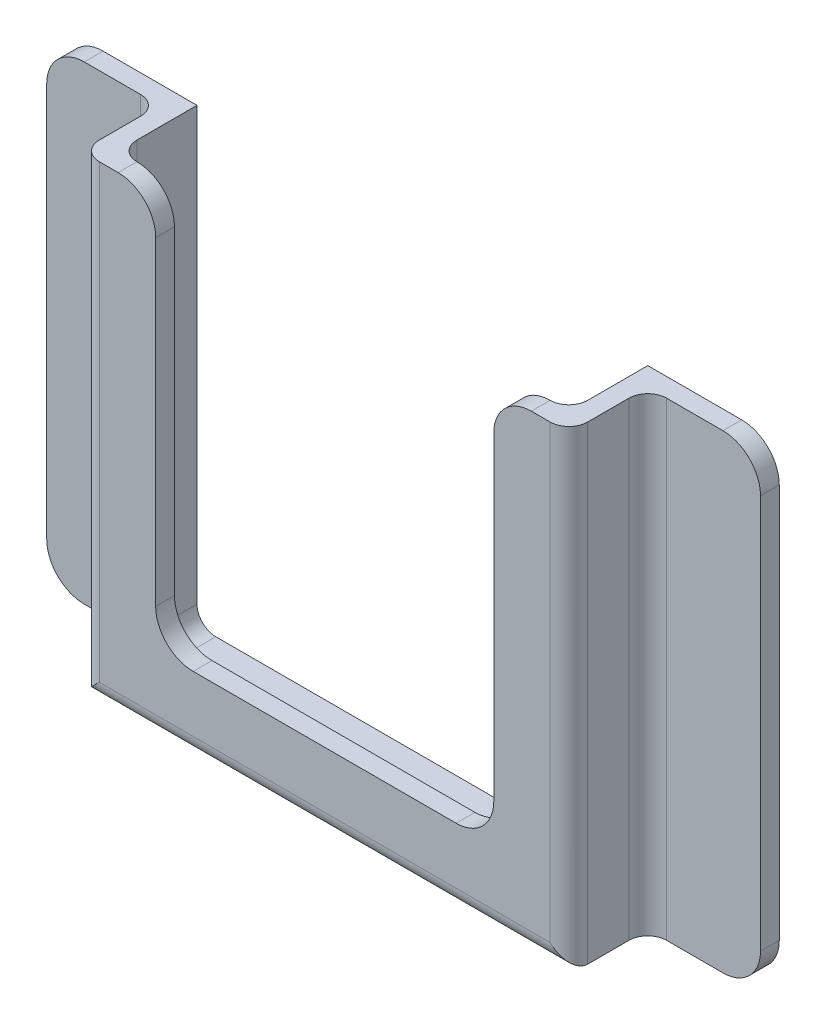
ISO-10303-21;
HEADER;
FILE_DESCRIPTION(('STEP AP214'),'2;1');
FILE_NAME('part.step','',(''),(''),'','','');
FILE_SCHEMA(('AUTOMOTIVE_DESIGN { 1 0 10303 214 1 1 1 1 }'));
ENDSEC;
DATA;
#1=APPLICATION_CONTEXT('core data for automotive mechanical design processes');
#2=APPLICATION_PROTOCOL_DEFINITION('international standard','automotive_design',2000,#1);
#3=PRODUCT_CONTEXT('',#1,'mechanical');
#4=PRODUCT('Part','Part','',(#3));
#5=PRODUCT_RELATED_PRODUCT_CATEGORY('part','',(#4));
#6=PRODUCT_DEFINITION_FORMATION('','',#4);
#7=PRODUCT_DEFINITION_CONTEXT('part definition',#1,'design');
#8=PRODUCT_DEFINITION('design','',#6,#7);
#9=PRODUCT_DEFINITION_SHAPE('','',#8);
#10=(LENGTH_UNIT() NAMED_UNIT(*) SI_UNIT(.MILLI.,.METRE.));
#11=(NAMED_UNIT(*) PLANE_ANGLE_UNIT() SI_UNIT($,.RADIAN.));
#12=(NAMED_UNIT(*) SI_UNIT($,.STERADIAN.) SOLID_ANGLE_UNIT());
#13=UNCERTAINTY_MEASURE_WITH_UNIT(LENGTH_MEASURE(1.E-05),#10,'distance_accuracy_value','');
#14=(GEOMETRIC_REPRESENTATION_CONTEXT(3) GLOBAL_UNCERTAINTY_ASSIGNED_CONTEXT((#13)) GLOBAL_UNIT_ASSIGNED_CONTEXT((#10,
#11,#12)) REPRESENTATION_CONTEXT('',''));
#15=CARTESIAN_POINT('',(0.,0.,0.));
#16=DIRECTION('',(0.,0.,1.));
#17=DIRECTION('',(1.,0.,0.));
#18=AXIS2_PLACEMENT_3D('',#15,#16,#17);
#19=CARTESIAN_POINT('',(0.,0.,10.5));
#20=DIRECTION('',(-1.,0.,0.));
#21=DIRECTION('',(0.,-1.,0.));
#22=AXIS2_PLACEMENT_3D('',#19,#20,#21);
#23=PLANE('',#22);
#24=DIRECTION('',(0.,0.,-1.));
#25=VECTOR('',#24,1.);
#26=CARTESIAN_POINT('',(0.,60.,10.5));
#27=LINE('',#26,#25);
#28=CARTESIAN_POINT('',(0.,60.,8.));
#29=VERTEX_POINT('',#28);
#30=CARTESIAN_POINT('',(0.,60.,0.));
#31=VERTEX_POINT('',#30);
#32=EDGE_CURVE('E244',#29,#31,#27,.T.);
#33=ORIENTED_EDGE('',*,*,#32,.F.);
#34=DIRECTION('',(0.,1.,0.));
#35=VECTOR('',#34,1.);
#36=CARTESIAN_POINT('',(0.,0.,8.));
#37=LINE('',#36,#35);
#38=CARTESIAN_POINT('',(0.,2.5,8.));
#39=VERTEX_POINT('',#38);
#40=EDGE_CURVE('E357',#29,#39,#37,.F.);
#41=ORIENTED_EDGE('',*,*,#40,.T.);
#42=DIRECTION('',(0.,0.,-1.));
#43=VECTOR('',#42,1.);
#44=CARTESIAN_POINT('',(0.,2.5,0.));
#45=LINE('',#44,#43);
#46=CARTESIAN_POINT('',(0.,2.5,0.));
#47=VERTEX_POINT('',#46);
#48=EDGE_CURVE('E247',#39,#47,#45,.T.);
#49=ORIENTED_EDGE('',*,*,#48,.T.);
#50=DIRECTION('',(0.,1.,0.));
#51=VECTOR('',#50,1.);
#52=CARTESIAN_POINT('',(0.,0.,0.));
#53=LINE('',#52,#51);
#54=EDGE_CURVE('E242',#47,#31,#53,.T.);
#55=ORIENTED_EDGE('',*,*,#54,.T.);
#56=EDGE_LOOP('',(#33,#41,#49,#55));
#57=FACE_BOUND('',#56,.T.);
#58=ADVANCED_FACE('F43',(#57),#23,.F.);
#59=CARTESIAN_POINT('',(-2.5,60.,10.5));
#60=DIRECTION('',(0.,-1.,0.));
#61=DIRECTION('',(0.,0.,-1.));
#62=AXIS2_PLACEMENT_3D('',#59,#60,#61);
#63=PLANE('',#62);
#64=DIRECTION('',(-1.,0.,0.));
#65=VECTOR('',#64,1.);
#66=CARTESIAN_POINT('',(-2.5,60.,0.));
#67=LINE('',#66,#65);
#68=CARTESIAN_POINT('',(-12.5,60.,0.));
#69=VERTEX_POINT('',#68);
#70=EDGE_CURVE('E252',#31,#69,#67,.T.);
#71=ORIENTED_EDGE('',*,*,#70,.T.);
#72=DIRECTION('',(0.,0.,-1.));
#73=VECTOR('',#72,1.);
#74=CARTESIAN_POINT('',(-12.5,60.,2.5));
#75=LINE('',#74,#73);
#76=CARTESIAN_POINT('',(-12.5,60.,2.5));
#77=VERTEX_POINT('',#76);
#78=EDGE_CURVE('E435',#69,#77,#75,.F.);
#79=ORIENTED_EDGE('',*,*,#78,.T.);
#80=DIRECTION('',(1.,0.,0.));
#81=VECTOR('',#80,1.);
#82=CARTESIAN_POINT('',(-2.5,60.,2.5));
#83=LINE('',#82,#81);
#84=CARTESIAN_POINT('',(-5.,60.,2.5));
#85=VERTEX_POINT('',#84);
#86=EDGE_CURVE('E408',#77,#85,#83,.T.);
#87=ORIENTED_EDGE('',*,*,#86,.T.);
#88=CARTESIAN_POINT('',(-5.,60.,5.));
#89=DIRECTION('',(0.,-1.,0.));
#90=DIRECTION('',(0.,0.,-1.));
#91=AXIS2_PLACEMENT_3D('',#88,#89,#90);
#92=CIRCLE('',#91,2.5);
#93=CARTESIAN_POINT('',(-2.5,60.,5.));
#94=VERTEX_POINT('',#93);
#95=EDGE_CURVE('E383',#85,#94,#92,.T.);
#96=ORIENTED_EDGE('',*,*,#95,.T.);
#97=DIRECTION('',(0.,0.,-1.));
#98=VECTOR('',#97,1.);
#99=CARTESIAN_POINT('',(-2.5,60.,10.5));
#100=LINE('',#99,#98);
#101=CARTESIAN_POINT('',(-2.5,60.,10.5));
#102=VERTEX_POINT('',#101);
#103=EDGE_CURVE('E264',#102,#94,#100,.T.);
#104=ORIENTED_EDGE('',*,*,#103,.F.);
#105=CARTESIAN_POINT('',(0.,60.,10.5));
#106=DIRECTION('',(0.,-1.,0.));
#107=DIRECTION('',(0.,0.,-1.));
#108=AXIS2_PLACEMENT_3D('',#105,#106,#107);
#109=CIRCLE('',#108,2.5);
#110=CARTESIAN_POINT('',(0.,60.,13.));
#111=VERTEX_POINT('',#110);
#112=EDGE_CURVE('E337',#102,#111,#109,.F.);
#113=ORIENTED_EDGE('',*,*,#112,.T.);
#114=DIRECTION('',(-1.,0.,0.));
#115=VECTOR('',#114,1.);
#116=CARTESIAN_POINT('',(-2.5,60.,13.));
#117=LINE('',#116,#115);
#118=CARTESIAN_POINT('',(2.5,60.,13.));
#119=VERTEX_POINT('',#118);
#120=EDGE_CURVE('E253',#119,#111,#117,.T.);
#121=ORIENTED_EDGE('',*,*,#120,.F.);
#122=DIRECTION('',(0.,0.,-1.));
#123=VECTOR('',#122,1.);
#124=CARTESIAN_POINT('',(2.5,60.,10.5));
#125=LINE('',#124,#123);
#126=CARTESIAN_POINT('',(2.49999999999999,60.,10.5));
#127=VERTEX_POINT('',#126);
#128=EDGE_CURVE('E432',#119,#127,#125,.T.);
#129=ORIENTED_EDGE('',*,*,#128,.T.);
#130=CARTESIAN_POINT('',(2.49999999999999,60.,8.));
#131=DIRECTION('',(0.,-1.,0.));
#132=DIRECTION('',(0.,0.,-1.));
#133=AXIS2_PLACEMENT_3D('',#130,#131,#132);
#134=CIRCLE('',#133,2.5);
#135=EDGE_CURVE('E261',#127,#29,#134,.T.);
#136=ORIENTED_EDGE('',*,*,#135,.T.);
#137=ORIENTED_EDGE('',*,*,#32,.T.);
#138=EDGE_LOOP('',(#71,#79,#87,#96,#104,#113,#121,#129,#136,#137));
#139=FACE_BOUND('',#138,.T.);
#140=ADVANCED_FACE('F257',(#139),#63,.F.);
#141=CARTESIAN_POINT('',(-2.5,-2.5,10.5));
#142=DIRECTION('',(1.,0.,0.));
#143=DIRECTION('',(0.,0.,-1.));
#144=AXIS2_PLACEMENT_3D('',#141,#142,#143);
#145=PLANE('',#144);
#146=DIRECTION('',(0.,0.,-1.));
#147=VECTOR('',#146,1.);
#148=CARTESIAN_POINT('',(-2.5,-2.5,10.5));
#149=LINE('',#148,#147);
#150=CARTESIAN_POINT('',(-2.5,-2.5,10.5));
#151=VERTEX_POINT('',#150);
#152=CARTESIAN_POINT('',(-2.5,-2.5,5.));
#153=VERTEX_POINT('',#152);
#154=EDGE_CURVE('E301',#151,#153,#149,.T.);
#155=ORIENTED_EDGE('',*,*,#154,.F.);
#156=DIRECTION('',(0.,-1.,0.));
#157=VECTOR('',#156,1.);
#158=CARTESIAN_POINT('',(-2.5,-2.5,10.5));
#159=LINE('',#158,#157);
#160=EDGE_CURVE('E334',#151,#102,#159,.F.);
#161=ORIENTED_EDGE('',*,*,#160,.T.);
#162=ORIENTED_EDGE('',*,*,#103,.T.);
#163=DIRECTION('',(0.,-1.,0.));
#164=VECTOR('',#163,1.);
#165=CARTESIAN_POINT('',(-2.5,-2.5,5.));
#166=LINE('',#165,#164);
#167=EDGE_CURVE('E330',#94,#153,#166,.T.);
#168=ORIENTED_EDGE('',*,*,#167,.T.);
#169=EDGE_LOOP('',(#155,#161,#162,#168));
#170=FACE_BOUND('',#169,.T.);
#171=ADVANCED_FACE('F582',(#170),#145,.F.);
#172=CARTESIAN_POINT('',(-2.5,-2.5,10.5));
#173=DIRECTION('',(0.,1.,0.));
#174=DIRECTION('',(0.,0.,1.));
#175=AXIS2_PLACEMENT_3D('',#172,#173,#174);
#176=PLANE('',#175);
#177=DIRECTION('',(-1.,0.,0.));
#178=VECTOR('',#177,1.);
#179=CARTESIAN_POINT('',(-2.5,-2.5,2.5));
#180=LINE('',#179,#178);
#181=CARTESIAN_POINT('',(-5.,-2.5,2.5));
#182=VERTEX_POINT('',#181);
#183=CARTESIAN_POINT('',(-12.5,-2.5,2.5));
#184=VERTEX_POINT('',#183);
#185=EDGE_CURVE('E643',#182,#184,#180,.T.);
#186=ORIENTED_EDGE('',*,*,#185,.T.);
#187=DIRECTION('',(0.,0.,-1.));
#188=VECTOR('',#187,1.);
#189=CARTESIAN_POINT('',(-12.5,-2.5,0.));
#190=LINE('',#189,#188);
#191=CARTESIAN_POINT('',(-12.5,-2.5,0.));
#192=VERTEX_POINT('',#191);
#193=EDGE_CURVE('E447',#184,#192,#190,.T.);
#194=ORIENTED_EDGE('',*,*,#193,.T.);
#195=DIRECTION('',(1.,0.,0.));
#196=VECTOR('',#195,1.);
#197=CARTESIAN_POINT('',(-2.5,-2.5,0.));
#198=LINE('',#197,#196);
#199=CARTESIAN_POINT('',(72.5,-2.5,0.));
#200=VERTEX_POINT('',#199);
#201=EDGE_CURVE('E270',#192,#200,#198,.T.);
#202=ORIENTED_EDGE('',*,*,#201,.T.);
#203=DIRECTION('',(0.,0.,-1.));
#204=VECTOR('',#203,1.);
#205=CARTESIAN_POINT('',(72.5,-2.5,2.5));
#206=LINE('',#205,#204);
#207=CARTESIAN_POINT('',(72.5,-2.5,2.5));
#208=VERTEX_POINT('',#207);
#209=EDGE_CURVE('E444',#200,#208,#206,.F.);
#210=ORIENTED_EDGE('',*,*,#209,.T.);
#211=DIRECTION('',(-1.,0.,0.));
#212=VECTOR('',#211,1.);
#213=CARTESIAN_POINT('',(62.5,-2.5,2.5));
#214=LINE('',#213,#212);
#215=CARTESIAN_POINT('',(65.,-2.5,2.5));
#216=VERTEX_POINT('',#215);
#217=EDGE_CURVE('E525',#208,#216,#214,.T.);
#218=ORIENTED_EDGE('',*,*,#217,.T.);
#219=CARTESIAN_POINT('',(65.,-2.5,5.));
#220=DIRECTION('',(0.,1.,0.));
#221=DIRECTION('',(0.,0.,1.));
#222=AXIS2_PLACEMENT_3D('',#219,#220,#221);
#223=CIRCLE('',#222,2.5);
#224=CARTESIAN_POINT('',(62.5,-2.5,5.));
#225=VERTEX_POINT('',#224);
#226=EDGE_CURVE('E389',#216,#225,#223,.T.);
#227=ORIENTED_EDGE('',*,*,#226,.T.);
#228=DIRECTION('',(0.,0.,-1.));
#229=VECTOR('',#228,1.);
#230=CARTESIAN_POINT('',(62.5,-2.5,10.5));
#231=LINE('',#230,#229);
#232=CARTESIAN_POINT('',(62.5,-2.5,10.5));
#233=VERTEX_POINT('',#232);
#234=EDGE_CURVE('E297',#233,#225,#231,.T.);
#235=ORIENTED_EDGE('',*,*,#234,.F.);
#236=DIRECTION('',(1.,0.,0.));
#237=VECTOR('',#236,1.);
#238=CARTESIAN_POINT('',(-2.5,-2.5,10.5));
#239=LINE('',#238,#237);
#240=EDGE_CURVE('E327',#233,#151,#239,.F.);
#241=ORIENTED_EDGE('',*,*,#240,.T.);
#242=ORIENTED_EDGE('',*,*,#154,.T.);
#243=CARTESIAN_POINT('',(-5.,-2.5,5.));
#244=DIRECTION('',(0.,1.,0.));
#245=DIRECTION('',(0.,0.,1.));
#246=AXIS2_PLACEMENT_3D('',#243,#244,#245);
#247=CIRCLE('',#246,2.5);
#248=EDGE_CURVE('E380',#153,#182,#247,.T.);
#249=ORIENTED_EDGE('',*,*,#248,.T.);
#250=EDGE_LOOP('',(#186,#194,#202,#210,#218,#227,#235,#241,#242,#249));
#251=FACE_BOUND('',#250,.T.);
#252=ADVANCED_FACE('F670',(#251),#176,.F.);
#253=CARTESIAN_POINT('',(62.5,-2.5,10.5));
#254=DIRECTION('',(-1.,0.,0.));
#255=DIRECTION('',(0.,0.,1.));
#256=AXIS2_PLACEMENT_3D('',#253,#254,#255);
#257=PLANE('',#256);
#258=DIRECTION('',(0.,0.,-1.));
#259=VECTOR('',#258,1.);
#260=CARTESIAN_POINT('',(62.5,60.,10.5));
#261=LINE('',#260,#259);
#262=CARTESIAN_POINT('',(62.5,60.,10.5));
#263=VERTEX_POINT('',#262);
#264=CARTESIAN_POINT('',(62.5,60.,5.));
#265=VERTEX_POINT('',#264);
#266=EDGE_CURVE('E293',#263,#265,#261,.T.);
#267=ORIENTED_EDGE('',*,*,#266,.F.);
#268=DIRECTION('',(0.,1.,0.));
#269=VECTOR('',#268,1.);
#270=CARTESIAN_POINT('',(62.5,-2.5,10.5));
#271=LINE('',#270,#269);
#272=EDGE_CURVE('E324',#263,#233,#271,.F.);
#273=ORIENTED_EDGE('',*,*,#272,.T.);
#274=ORIENTED_EDGE('',*,*,#234,.T.);
#275=DIRECTION('',(0.,1.,0.));
#276=VECTOR('',#275,1.);
#277=CARTESIAN_POINT('',(62.5,60.,5.));
#278=LINE('',#277,#276);
#279=EDGE_CURVE('E320',#225,#265,#278,.T.);
#280=ORIENTED_EDGE('',*,*,#279,.T.);
#281=EDGE_LOOP('',(#267,#273,#274,#280));
#282=FACE_BOUND('',#281,.T.);
#283=ADVANCED_FACE('F727',(#282),#257,.F.);
#284=CARTESIAN_POINT('',(60.,60.,10.5));
#285=DIRECTION('',(0.,-1.,0.));
#286=DIRECTION('',(0.,0.,-1.));
#287=AXIS2_PLACEMENT_3D('',#284,#285,#286);
#288=PLANE('',#287);
#289=DIRECTION('',(1.,0.,0.));
#290=VECTOR('',#289,1.);
#291=CARTESIAN_POINT('',(62.5,60.,2.5));
#292=LINE('',#291,#290);
#293=CARTESIAN_POINT('',(65.,60.,2.5));
#294=VERTEX_POINT('',#293);
#295=CARTESIAN_POINT('',(72.5,60.,2.5));
#296=VERTEX_POINT('',#295);
#297=EDGE_CURVE('E633',#294,#296,#292,.T.);
#298=ORIENTED_EDGE('',*,*,#297,.T.);
#299=DIRECTION('',(0.,0.,-1.));
#300=VECTOR('',#299,1.);
#301=CARTESIAN_POINT('',(72.5,60.,0.));
#302=LINE('',#301,#300);
#303=CARTESIAN_POINT('',(72.5,60.,0.));
#304=VERTEX_POINT('',#303);
#305=EDGE_CURVE('E467',#296,#304,#302,.T.);
#306=ORIENTED_EDGE('',*,*,#305,.T.);
#307=DIRECTION('',(-1.,0.,0.));
#308=VECTOR('',#307,1.);
#309=CARTESIAN_POINT('',(60.,60.,0.));
#310=LINE('',#309,#308);
#311=CARTESIAN_POINT('',(60.,60.,0.));
#312=VERTEX_POINT('',#311);
#313=EDGE_CURVE('E274',#304,#312,#310,.T.);
#314=ORIENTED_EDGE('',*,*,#313,.T.);
#315=DIRECTION('',(0.,0.,-1.));
#316=VECTOR('',#315,1.);
#317=CARTESIAN_POINT('',(60.,60.,10.5));
#318=LINE('',#317,#316);
#319=CARTESIAN_POINT('',(60.,60.,8.));
#320=VERTEX_POINT('',#319);
#321=EDGE_CURVE('E289',#320,#312,#318,.T.);
#322=ORIENTED_EDGE('',*,*,#321,.F.);
#323=CARTESIAN_POINT('',(57.5,60.,8.));
#324=DIRECTION('',(0.,-1.,0.));
#325=DIRECTION('',(0.,0.,-1.));
#326=AXIS2_PLACEMENT_3D('',#323,#324,#325);
#327=CIRCLE('',#326,2.5);
#328=CARTESIAN_POINT('',(57.5,60.,10.5));
#329=VERTEX_POINT('',#328);
#330=EDGE_CURVE('E374',#320,#329,#327,.T.);
#331=ORIENTED_EDGE('',*,*,#330,.T.);
#332=DIRECTION('',(0.,0.,-1.));
#333=VECTOR('',#332,1.);
#334=CARTESIAN_POINT('',(57.5,60.,10.5));
#335=LINE('',#334,#333);
#336=CARTESIAN_POINT('',(57.5,60.,13.));
#337=VERTEX_POINT('',#336);
#338=EDGE_CURVE('E464',#329,#337,#335,.F.);
#339=ORIENTED_EDGE('',*,*,#338,.T.);
#340=DIRECTION('',(-1.,0.,0.));
#341=VECTOR('',#340,1.);
#342=CARTESIAN_POINT('',(52.5,60.,13.));
#343=LINE('',#342,#341);
#344=CARTESIAN_POINT('',(60.,60.,13.));
#345=VERTEX_POINT('',#344);
#346=EDGE_CURVE('E542',#345,#337,#343,.T.);
#347=ORIENTED_EDGE('',*,*,#346,.F.);
#348=CARTESIAN_POINT('',(60.,60.,10.5));
#349=DIRECTION('',(0.,-1.,0.));
#350=DIRECTION('',(0.,0.,-1.));
#351=AXIS2_PLACEMENT_3D('',#348,#349,#350);
#352=CIRCLE('',#351,2.5);
#353=EDGE_CURVE('E317',#345,#263,#352,.F.);
#354=ORIENTED_EDGE('',*,*,#353,.T.);
#355=ORIENTED_EDGE('',*,*,#266,.T.);
#356=CARTESIAN_POINT('',(65.,60.,5.));
#357=DIRECTION('',(0.,-1.,0.));
#358=DIRECTION('',(0.,0.,-1.));
#359=AXIS2_PLACEMENT_3D('',#356,#357,#358);
#360=CIRCLE('',#359,2.5);
#361=EDGE_CURVE('E386',#265,#294,#360,.T.);
#362=ORIENTED_EDGE('',*,*,#361,.T.);
#363=EDGE_LOOP('',(#298,#306,#314,#322,#331,#339,#347,#354,#355,#362));
#364=FACE_BOUND('',#363,.T.);
#365=ADVANCED_FACE('F620',(#364),#288,.F.);
#366=CARTESIAN_POINT('',(60.,0.,10.5));
#367=DIRECTION('',(1.,0.,0.));
#368=DIRECTION('',(0.,1.,0.));
#369=AXIS2_PLACEMENT_3D('',#366,#367,#368);
#370=PLANE('',#369);
#371=DIRECTION('',(0.,0.,-1.));
#372=VECTOR('',#371,1.);
#373=CARTESIAN_POINT('',(60.,2.5,10.5));
#374=LINE('',#373,#372);
#375=CARTESIAN_POINT('',(60.,2.5,0.));
#376=VERTEX_POINT('',#375);
#377=CARTESIAN_POINT('',(60.,2.5,8.));
#378=VERTEX_POINT('',#377);
#379=EDGE_CURVE('E349',#376,#378,#374,.F.);
#380=ORIENTED_EDGE('',*,*,#379,.T.);
#381=DIRECTION('',(0.,-1.,0.));
#382=VECTOR('',#381,1.);
#383=CARTESIAN_POINT('',(60.,0.,8.));
#384=LINE('',#383,#382);
#385=EDGE_CURVE('E352',#378,#320,#384,.F.);
#386=ORIENTED_EDGE('',*,*,#385,.T.);
#387=ORIENTED_EDGE('',*,*,#321,.T.);
#388=DIRECTION('',(0.,-1.,0.));
#389=VECTOR('',#388,1.);
#390=CARTESIAN_POINT('',(60.,0.,0.));
#391=LINE('',#390,#389);
#392=EDGE_CURVE('E280',#312,#376,#391,.T.);
#393=ORIENTED_EDGE('',*,*,#392,.T.);
#394=EDGE_LOOP('',(#380,#386,#387,#393));
#395=FACE_BOUND('',#394,.T.);
#396=ADVANCED_FACE('F614',(#395),#370,.F.);
#397=CARTESIAN_POINT('',(0.,0.,10.5));
#398=DIRECTION('',(0.,-1.,0.));
#399=DIRECTION('',(0.,0.,-1.));
#400=AXIS2_PLACEMENT_3D('',#397,#398,#399);
#401=PLANE('',#400);
#402=DIRECTION('',(-1.,0.,0.));
#403=VECTOR('',#402,1.);
#404=CARTESIAN_POINT('',(0.,0.,0.));
#405=LINE('',#404,#403);
#406=CARTESIAN_POINT('',(57.5,0.,0.));
#407=VERTEX_POINT('',#406);
#408=CARTESIAN_POINT('',(2.5,0.,0.));
#409=VERTEX_POINT('',#408);
#410=EDGE_CURVE('E284',#407,#409,#405,.T.);
#411=ORIENTED_EDGE('',*,*,#410,.T.);
#412=DIRECTION('',(0.,0.,-1.));
#413=VECTOR('',#412,1.);
#414=CARTESIAN_POINT('',(2.5,0.,10.5));
#415=LINE('',#414,#413);
#416=CARTESIAN_POINT('',(2.5,0.,10.5));
#417=VERTEX_POINT('',#416);
#418=EDGE_CURVE('E371',#409,#417,#415,.F.);
#419=ORIENTED_EDGE('',*,*,#418,.T.);
#420=DIRECTION('',(-1.,0.,0.));
#421=VECTOR('',#420,1.);
#422=CARTESIAN_POINT('',(0.,0.,10.5));
#423=LINE('',#422,#421);
#424=CARTESIAN_POINT('',(57.5,0.,10.5));
#425=VERTEX_POINT('',#424);
#426=EDGE_CURVE('E288',#425,#417,#423,.T.);
#427=ORIENTED_EDGE('',*,*,#426,.F.);
#428=DIRECTION('',(0.,0.,-1.));
#429=VECTOR('',#428,1.);
#430=CARTESIAN_POINT('',(57.5,0.,0.));
#431=LINE('',#430,#429);
#432=EDGE_CURVE('E368',#425,#407,#431,.T.);
#433=ORIENTED_EDGE('',*,*,#432,.T.);
#434=EDGE_LOOP('',(#411,#419,#427,#433));
#435=FACE_BOUND('',#434,.T.);
#436=ADVANCED_FACE('F762',(#435),#401,.F.);
#437=CARTESIAN_POINT('',(0.,0.,0.));
#438=DIRECTION('',(0.,0.,-1.));
#439=DIRECTION('',(-1.,0.,0.));
#440=AXIS2_PLACEMENT_3D('',#437,#438,#439);
#441=PLANE('',#440);
#442=DIRECTION('',(0.,1.,0.));
#443=VECTOR('',#442,1.);
#444=CARTESIAN_POINT('',(-17.5,-2.5,0.));
#445=LINE('',#444,#443);
#446=CARTESIAN_POINT('',(-17.5,2.5,0.));
#447=VERTEX_POINT('',#446);
#448=CARTESIAN_POINT('',(-17.5,55.,0.));
#449=VERTEX_POINT('',#448);
#450=EDGE_CURVE('E634',#447,#449,#445,.T.);
#451=ORIENTED_EDGE('',*,*,#450,.T.);
#452=CARTESIAN_POINT('',(-12.5,55.,0.));
#453=DIRECTION('',(0.,0.,-1.));
#454=DIRECTION('',(-1.,0.,0.));
#455=AXIS2_PLACEMENT_3D('',#452,#453,#454);
#456=CIRCLE('',#455,5.);
#457=EDGE_CURVE('E268',#449,#69,#456,.T.);
#458=ORIENTED_EDGE('',*,*,#457,.T.);
#459=ORIENTED_EDGE('',*,*,#70,.F.);
#460=ORIENTED_EDGE('',*,*,#54,.F.);
#461=CARTESIAN_POINT('',(2.5,2.5,0.));
#462=DIRECTION('',(0.,0.,-1.));
#463=DIRECTION('',(-1.,0.,0.));
#464=AXIS2_PLACEMENT_3D('',#461,#462,#463);
#465=CIRCLE('',#464,2.5);
#466=EDGE_CURVE('E392',#47,#409,#465,.F.);
#467=ORIENTED_EDGE('',*,*,#466,.T.);
#468=ORIENTED_EDGE('',*,*,#410,.F.);
#469=CARTESIAN_POINT('',(57.5,2.5,0.));
#470=DIRECTION('',(0.,0.,-1.));
#471=DIRECTION('',(-1.,0.,0.));
#472=AXIS2_PLACEMENT_3D('',#469,#470,#471);
#473=CIRCLE('',#472,2.5);
#474=EDGE_CURVE('E395',#407,#376,#473,.F.);
#475=ORIENTED_EDGE('',*,*,#474,.T.);
#476=ORIENTED_EDGE('',*,*,#392,.F.);
#477=ORIENTED_EDGE('',*,*,#313,.F.);
#478=CARTESIAN_POINT('',(72.5,55.,0.));
#479=DIRECTION('',(0.,0.,-1.));
#480=DIRECTION('',(-1.,0.,0.));
#481=AXIS2_PLACEMENT_3D('',#478,#479,#480);
#482=CIRCLE('',#481,5.);
#483=CARTESIAN_POINT('',(77.5,55.,0.));
#484=VERTEX_POINT('',#483);
#485=EDGE_CURVE('E421',#304,#484,#482,.T.);
#486=ORIENTED_EDGE('',*,*,#485,.T.);
#487=DIRECTION('',(0.,-1.,0.));
#488=VECTOR('',#487,1.);
#489=CARTESIAN_POINT('',(77.5,-2.5,0.));
#490=LINE('',#489,#488);
#491=CARTESIAN_POINT('',(77.5,2.5,0.));
#492=VERTEX_POINT('',#491);
#493=EDGE_CURVE('E629',#484,#492,#490,.T.);
#494=ORIENTED_EDGE('',*,*,#493,.T.);
#495=CARTESIAN_POINT('',(72.5,2.5,0.));
#496=DIRECTION('',(0.,0.,-1.));
#497=DIRECTION('',(-1.,0.,0.));
#498=AXIS2_PLACEMENT_3D('',#495,#496,#497);
#499=CIRCLE('',#498,5.);
#500=EDGE_CURVE('E424',#492,#200,#499,.T.);
#501=ORIENTED_EDGE('',*,*,#500,.T.);
#502=ORIENTED_EDGE('',*,*,#201,.F.);
#503=CARTESIAN_POINT('',(-12.5,2.5,0.));
#504=DIRECTION('',(0.,0.,-1.));
#505=DIRECTION('',(-1.,0.,0.));
#506=AXIS2_PLACEMENT_3D('',#503,#504,#505);
#507=CIRCLE('',#506,5.);
#508=EDGE_CURVE('E427',#192,#447,#507,.T.);
#509=ORIENTED_EDGE('',*,*,#508,.T.);
#510=EDGE_LOOP('',(#451,#458,#459,#460,#467,#468,#475,#476,#477,#486,#494,#501,#502,#509));
#511=FACE_BOUND('',#510,.T.);
#512=ADVANCED_FACE('F267',(#511),#441,.T.);
#513=CARTESIAN_POINT('',(52.5,60.,13.));
#514=DIRECTION('',(1.,0.,0.));
#515=DIRECTION('',(0.,1.,0.));
#516=AXIS2_PLACEMENT_3D('',#513,#514,#515);
#517=PLANE('',#516);
#518=DIRECTION('',(0.,-1.,0.));
#519=VECTOR('',#518,1.);
#520=CARTESIAN_POINT('',(52.5,60.,13.));
#521=LINE('',#520,#519);
#522=CARTESIAN_POINT('',(52.5,55.,13.));
#523=VERTEX_POINT('',#522);
#524=CARTESIAN_POINT('',(52.5,12.5,13.));
#525=VERTEX_POINT('',#524);
#526=EDGE_CURVE('E532',#523,#525,#521,.T.);
#527=ORIENTED_EDGE('',*,*,#526,.F.);
#528=DIRECTION('',(0.,0.,-1.));
#529=VECTOR('',#528,1.);
#530=CARTESIAN_POINT('',(52.5,55.,13.));
#531=LINE('',#530,#529);
#532=CARTESIAN_POINT('',(52.5,55.,10.5));
#533=VERTEX_POINT('',#532);
#534=EDGE_CURVE('E474',#523,#533,#531,.T.);
#535=ORIENTED_EDGE('',*,*,#534,.T.);
#536=DIRECTION('',(0.,-1.,0.));
#537=VECTOR('',#536,1.);
#538=CARTESIAN_POINT('',(52.5,60.,10.5));
#539=LINE('',#538,#537);
#540=CARTESIAN_POINT('',(52.5,12.5,10.5));
#541=VERTEX_POINT('',#540);
#542=EDGE_CURVE('E513',#533,#541,#539,.T.);
#543=ORIENTED_EDGE('',*,*,#542,.T.);
#544=DIRECTION('',(0.,0.,-1.));
#545=VECTOR('',#544,1.);
#546=CARTESIAN_POINT('',(52.5,12.5,13.));
#547=LINE('',#546,#545);
#548=EDGE_CURVE('E471',#541,#525,#547,.F.);
#549=ORIENTED_EDGE('',*,*,#548,.T.);
#550=EDGE_LOOP('',(#527,#535,#543,#549));
#551=FACE_BOUND('',#550,.T.);
#552=ADVANCED_FACE('F521',(#551),#517,.F.);
#553=CARTESIAN_POINT('',(7.50000000000001,7.5,13.));
#554=DIRECTION('',(0.,-1.,0.));
#555=DIRECTION('',(0.,0.,-1.));
#556=AXIS2_PLACEMENT_3D('',#553,#554,#555);
#557=PLANE('',#556);
#558=DIRECTION('',(-1.,0.,0.));
#559=VECTOR('',#558,1.);
#560=CARTESIAN_POINT('',(7.50000000000001,7.5,10.5));
#561=LINE('',#560,#559);
#562=CARTESIAN_POINT('',(47.5,7.5,10.5));
#563=VERTEX_POINT('',#562);
#564=CARTESIAN_POINT('',(12.5,7.5,10.5));
#565=VERTEX_POINT('',#564);
#566=EDGE_CURVE('E515',#563,#565,#561,.T.);
#567=ORIENTED_EDGE('',*,*,#566,.T.);
#568=DIRECTION('',(0.,0.,-1.));
#569=VECTOR('',#568,1.);
#570=CARTESIAN_POINT('',(12.5,7.5,13.));
#571=LINE('',#570,#569);
#572=CARTESIAN_POINT('',(12.5,7.5,13.));
#573=VERTEX_POINT('',#572);
#574=EDGE_CURVE('E500',#565,#573,#571,.F.);
#575=ORIENTED_EDGE('',*,*,#574,.T.);
#576=DIRECTION('',(-1.,0.,0.));
#577=VECTOR('',#576,1.);
#578=CARTESIAN_POINT('',(7.50000000000001,7.5,13.));
#579=LINE('',#578,#577);
#580=CARTESIAN_POINT('',(47.5,7.5,13.));
#581=VERTEX_POINT('',#580);
#582=EDGE_CURVE('E531',#581,#573,#579,.T.);
#583=ORIENTED_EDGE('',*,*,#582,.F.);
#584=DIRECTION('',(0.,0.,-1.));
#585=VECTOR('',#584,1.);
#586=CARTESIAN_POINT('',(47.5,7.5,10.5));
#587=LINE('',#586,#585);
#588=EDGE_CURVE('E496',#581,#563,#587,.T.);
#589=ORIENTED_EDGE('',*,*,#588,.T.);
#590=EDGE_LOOP('',(#567,#575,#583,#589));
#591=FACE_BOUND('',#590,.T.);
#592=ADVANCED_FACE('F534',(#591),#557,.F.);
#593=CARTESIAN_POINT('',(7.5,60.,13.));
#594=DIRECTION('',(-1.,0.,0.));
#595=DIRECTION('',(0.,-1.,0.));
#596=AXIS2_PLACEMENT_3D('',#593,#594,#595);
#597=PLANE('',#596);
#598=DIRECTION('',(0.,1.,0.));
#599=VECTOR('',#598,1.);
#600=CARTESIAN_POINT('',(7.5,60.,10.5));
#601=LINE('',#600,#599);
#602=CARTESIAN_POINT('',(7.50000000000001,12.5,10.5));
#603=VERTEX_POINT('',#602);
#604=CARTESIAN_POINT('',(7.5,55.,10.5));
#605=VERTEX_POINT('',#604);
#606=EDGE_CURVE('E550',#603,#605,#601,.T.);
#607=ORIENTED_EDGE('',*,*,#606,.T.);
#608=DIRECTION('',(0.,0.,-1.));
#609=VECTOR('',#608,1.);
#610=CARTESIAN_POINT('',(7.5,55.,13.));
#611=LINE('',#610,#609);
#612=CARTESIAN_POINT('',(7.5,55.,13.));
#613=VERTEX_POINT('',#612);
#614=EDGE_CURVE('E59',#605,#613,#611,.F.);
#615=ORIENTED_EDGE('',*,*,#614,.T.);
#616=DIRECTION('',(0.,1.,0.));
#617=VECTOR('',#616,1.);
#618=CARTESIAN_POINT('',(7.5,60.,13.));
#619=LINE('',#618,#617);
#620=CARTESIAN_POINT('',(7.50000000000001,12.5,13.));
#621=VERTEX_POINT('',#620);
#622=EDGE_CURVE('E537',#621,#613,#619,.T.);
#623=ORIENTED_EDGE('',*,*,#622,.F.);
#624=DIRECTION('',(0.,0.,-1.));
#625=VECTOR('',#624,1.);
#626=CARTESIAN_POINT('',(7.50000000000001,12.5,10.5));
#627=LINE('',#626,#625);
#628=EDGE_CURVE('E490',#621,#603,#627,.T.);
#629=ORIENTED_EDGE('',*,*,#628,.T.);
#630=EDGE_LOOP('',(#607,#615,#623,#629));
#631=FACE_BOUND('',#630,.T.);
#632=ADVANCED_FACE('F688',(#631),#597,.F.);
#633=CARTESIAN_POINT('',(0.,0.,13.));
#634=DIRECTION('',(0.,0.,-1.));
#635=DIRECTION('',(-1.,0.,0.));
#636=AXIS2_PLACEMENT_3D('',#633,#634,#635);
#637=PLANE('',#636);
#638=ORIENTED_EDGE('',*,*,#346,.T.);
#639=CARTESIAN_POINT('',(57.5,55.,13.));
#640=DIRECTION('',(0.,0.,-1.));
#641=DIRECTION('',(-1.,0.,0.));
#642=AXIS2_PLACEMENT_3D('',#639,#640,#641);
#643=CIRCLE('',#642,5.);
#644=EDGE_CURVE('E487',#337,#523,#643,.F.);
#645=ORIENTED_EDGE('',*,*,#644,.T.);
#646=ORIENTED_EDGE('',*,*,#526,.T.);
#647=CARTESIAN_POINT('',(47.5,12.5,13.));
#648=DIRECTION('',(0.,0.,-1.));
#649=DIRECTION('',(-1.,0.,0.));
#650=AXIS2_PLACEMENT_3D('',#647,#648,#649);
#651=CIRCLE('',#650,5.);
#652=EDGE_CURVE('E11',#525,#581,#651,.T.);
#653=ORIENTED_EDGE('',*,*,#652,.T.);
#654=ORIENTED_EDGE('',*,*,#582,.T.);
#655=CARTESIAN_POINT('',(12.5,12.5,13.));
#656=DIRECTION('',(0.,0.,-1.));
#657=DIRECTION('',(-1.,0.,0.));
#658=AXIS2_PLACEMENT_3D('',#655,#656,#657);
#659=CIRCLE('',#658,5.);
#660=EDGE_CURVE('E66',#573,#621,#659,.T.);
#661=ORIENTED_EDGE('',*,*,#660,.T.);
#662=ORIENTED_EDGE('',*,*,#622,.T.);
#663=CARTESIAN_POINT('',(2.5,55.,13.));
#664=DIRECTION('',(0.,0.,-1.));
#665=DIRECTION('',(-1.,0.,0.));
#666=AXIS2_PLACEMENT_3D('',#663,#664,#665);
#667=CIRCLE('',#666,5.);
#668=EDGE_CURVE('E484',#613,#119,#667,.F.);
#669=ORIENTED_EDGE('',*,*,#668,.T.);
#670=ORIENTED_EDGE('',*,*,#120,.T.);
#671=DIRECTION('',(0.,-1.,0.));
#672=VECTOR('',#671,1.);
#673=CARTESIAN_POINT('',(0.,0.,13.));
#674=LINE('',#673,#672);
#675=CARTESIAN_POINT('',(0.,0.,13.));
#676=VERTEX_POINT('',#675);
#677=EDGE_CURVE('E263',#111,#676,#674,.T.);
#678=ORIENTED_EDGE('',*,*,#677,.T.);
#679=DIRECTION('',(1.,0.,0.));
#680=VECTOR('',#679,1.);
#681=CARTESIAN_POINT('',(0.,0.,13.));
#682=LINE('',#681,#680);
#683=CARTESIAN_POINT('',(60.,0.,13.));
#684=VERTEX_POINT('',#683);
#685=EDGE_CURVE('E310',#676,#684,#682,.T.);
#686=ORIENTED_EDGE('',*,*,#685,.T.);
#687=DIRECTION('',(0.,1.,0.));
#688=VECTOR('',#687,1.);
#689=CARTESIAN_POINT('',(60.,0.,13.));
#690=LINE('',#689,#688);
#691=EDGE_CURVE('E313',#684,#345,#690,.T.);
#692=ORIENTED_EDGE('',*,*,#691,.T.);
#693=EDGE_LOOP('',(#638,#645,#646,#653,#654,#661,#662,#669,#670,#678,#686,#692));
#694=FACE_BOUND('',#693,.T.);
#695=ADVANCED_FACE('F530',(#694),#637,.F.);
#696=CARTESIAN_POINT('',(0.,0.,10.5));
#697=DIRECTION('',(0.,0.,-1.));
#698=DIRECTION('',(-1.,0.,0.));
#699=AXIS2_PLACEMENT_3D('',#696,#697,#698);
#700=PLANE('',#699);
#701=ORIENTED_EDGE('',*,*,#542,.F.);
#702=CARTESIAN_POINT('',(57.5,55.,10.5));
#703=DIRECTION('',(0.,0.,-1.));
#704=DIRECTION('',(-1.,0.,0.));
#705=AXIS2_PLACEMENT_3D('',#702,#703,#704);
#706=CIRCLE('',#705,5.);
#707=EDGE_CURVE('E481',#533,#329,#706,.T.);
#708=ORIENTED_EDGE('',*,*,#707,.T.);
#709=DIRECTION('',(0.,-1.,0.));
#710=VECTOR('',#709,1.);
#711=CARTESIAN_POINT('',(57.5,0.,10.5));
#712=LINE('',#711,#710);
#713=EDGE_CURVE('E345',#329,#425,#712,.T.);
#714=ORIENTED_EDGE('',*,*,#713,.T.);
#715=ORIENTED_EDGE('',*,*,#426,.T.);
#716=DIRECTION('',(0.,1.,0.));
#717=VECTOR('',#716,1.);
#718=CARTESIAN_POINT('',(2.5,0.,10.5));
#719=LINE('',#718,#717);
#720=EDGE_CURVE('E341',#417,#127,#719,.T.);
#721=ORIENTED_EDGE('',*,*,#720,.T.);
#722=CARTESIAN_POINT('',(2.5,55.,10.5));
#723=DIRECTION('',(0.,0.,-1.));
#724=DIRECTION('',(-1.,0.,0.));
#725=AXIS2_PLACEMENT_3D('',#722,#723,#724);
#726=CIRCLE('',#725,5.);
#727=EDGE_CURVE('E478',#127,#605,#726,.T.);
#728=ORIENTED_EDGE('',*,*,#727,.T.);
#729=ORIENTED_EDGE('',*,*,#606,.F.);
#730=CARTESIAN_POINT('',(12.5,12.5,10.5));
#731=DIRECTION('',(0.,0.,-1.));
#732=DIRECTION('',(-1.,0.,0.));
#733=AXIS2_PLACEMENT_3D('',#730,#731,#732);
#734=CIRCLE('',#733,5.);
#735=EDGE_CURVE('E503',#603,#565,#734,.F.);
#736=ORIENTED_EDGE('',*,*,#735,.T.);
#737=ORIENTED_EDGE('',*,*,#566,.F.);
#738=CARTESIAN_POINT('',(47.5,12.5,10.5));
#739=DIRECTION('',(0.,0.,-1.));
#740=DIRECTION('',(-1.,0.,0.));
#741=AXIS2_PLACEMENT_3D('',#738,#739,#740);
#742=CIRCLE('',#741,5.);
#743=EDGE_CURVE('E52',#563,#541,#742,.F.);
#744=ORIENTED_EDGE('',*,*,#743,.T.);
#745=EDGE_LOOP('',(#701,#708,#714,#715,#721,#728,#729,#736,#737,#744));
#746=FACE_BOUND('',#745,.T.);
#747=ADVANCED_FACE('F512',(#746),#700,.T.);
#748=CARTESIAN_POINT('',(77.5,-2.5,2.5));
#749=DIRECTION('',(1.,0.,0.));
#750=DIRECTION('',(0.,0.,-1.));
#751=AXIS2_PLACEMENT_3D('',#748,#749,#750);
#752=PLANE('',#751);
#753=DIRECTION('',(0.,-1.,0.));
#754=VECTOR('',#753,1.);
#755=CARTESIAN_POINT('',(77.5,-2.5,2.5));
#756=LINE('',#755,#754);
#757=CARTESIAN_POINT('',(77.5,55.,2.5));
#758=VERTEX_POINT('',#757);
#759=CARTESIAN_POINT('',(77.5,2.5,2.5));
#760=VERTEX_POINT('',#759);
#761=EDGE_CURVE('E637',#758,#760,#756,.T.);
#762=ORIENTED_EDGE('',*,*,#761,.T.);
#763=DIRECTION('',(0.,0.,-1.));
#764=VECTOR('',#763,1.);
#765=CARTESIAN_POINT('',(77.5,2.5,0.));
#766=LINE('',#765,#764);
#767=EDGE_CURVE('E454',#760,#492,#766,.T.);
#768=ORIENTED_EDGE('',*,*,#767,.T.);
#769=ORIENTED_EDGE('',*,*,#493,.F.);
#770=DIRECTION('',(0.,0.,-1.));
#771=VECTOR('',#770,1.);
#772=CARTESIAN_POINT('',(77.5,55.,2.5));
#773=LINE('',#772,#771);
#774=EDGE_CURVE('E451',#484,#758,#773,.F.);
#775=ORIENTED_EDGE('',*,*,#774,.T.);
#776=EDGE_LOOP('',(#762,#768,#769,#775));
#777=FACE_BOUND('',#776,.T.);
#778=ADVANCED_FACE('F738',(#777),#752,.T.);
#779=CARTESIAN_POINT('',(0.,0.,2.5));
#780=DIRECTION('',(0.,0.,-1.));
#781=DIRECTION('',(-1.,0.,0.));
#782=AXIS2_PLACEMENT_3D('',#779,#780,#781);
#783=PLANE('',#782);
#784=ORIENTED_EDGE('',*,*,#217,.F.);
#785=CARTESIAN_POINT('',(72.5,2.5,2.5));
#786=DIRECTION('',(0.,0.,-1.));
#787=DIRECTION('',(-1.,0.,0.));
#788=AXIS2_PLACEMENT_3D('',#785,#786,#787);
#789=CIRCLE('',#788,5.);
#790=EDGE_CURVE('E461',#208,#760,#789,.F.);
#791=ORIENTED_EDGE('',*,*,#790,.T.);
#792=ORIENTED_EDGE('',*,*,#761,.F.);
#793=CARTESIAN_POINT('',(72.5,55.,2.5));
#794=DIRECTION('',(0.,0.,-1.));
#795=DIRECTION('',(-1.,0.,0.));
#796=AXIS2_PLACEMENT_3D('',#793,#794,#795);
#797=CIRCLE('',#796,5.);
#798=EDGE_CURVE('E458',#758,#296,#797,.F.);
#799=ORIENTED_EDGE('',*,*,#798,.T.);
#800=ORIENTED_EDGE('',*,*,#297,.F.);
#801=DIRECTION('',(0.,1.,0.));
#802=VECTOR('',#801,1.);
#803=CARTESIAN_POINT('',(65.,-2.5,2.5));
#804=LINE('',#803,#802);
#805=EDGE_CURVE('E364',#294,#216,#804,.F.);
#806=ORIENTED_EDGE('',*,*,#805,.T.);
#807=EDGE_LOOP('',(#784,#791,#792,#799,#800,#806));
#808=FACE_BOUND('',#807,.T.);
#809=ADVANCED_FACE('F732',(#808),#783,.F.);
#810=CARTESIAN_POINT('',(-17.5,-2.5,2.5));
#811=DIRECTION('',(-1.,0.,0.));
#812=DIRECTION('',(0.,0.,1.));
#813=AXIS2_PLACEMENT_3D('',#810,#811,#812);
#814=PLANE('',#813);
#815=DIRECTION('',(0.,1.,0.));
#816=VECTOR('',#815,1.);
#817=CARTESIAN_POINT('',(-17.5,-2.5,2.5));
#818=LINE('',#817,#816);
#819=CARTESIAN_POINT('',(-17.5,2.5,2.5));
#820=VERTEX_POINT('',#819);
#821=CARTESIAN_POINT('',(-17.5,55.,2.5));
#822=VERTEX_POINT('',#821);
#823=EDGE_CURVE('E647',#820,#822,#818,.T.);
#824=ORIENTED_EDGE('',*,*,#823,.T.);
#825=DIRECTION('',(0.,0.,-1.));
#826=VECTOR('',#825,1.);
#827=CARTESIAN_POINT('',(-17.5,55.,0.));
#828=LINE('',#827,#826);
#829=EDGE_CURVE('E417',#822,#449,#828,.T.);
#830=ORIENTED_EDGE('',*,*,#829,.T.);
#831=ORIENTED_EDGE('',*,*,#450,.F.);
#832=DIRECTION('',(0.,0.,-1.));
#833=VECTOR('',#832,1.);
#834=CARTESIAN_POINT('',(-17.5,2.5,2.5));
#835=LINE('',#834,#833);
#836=EDGE_CURVE('E398',#447,#820,#835,.F.);
#837=ORIENTED_EDGE('',*,*,#836,.T.);
#838=EDGE_LOOP('',(#824,#830,#831,#837));
#839=FACE_BOUND('',#838,.T.);
#840=ADVANCED_FACE('F658',(#839),#814,.T.);
#841=CARTESIAN_POINT('',(0.,0.,2.5));
#842=DIRECTION('',(0.,0.,1.));
#843=DIRECTION('',(1.,0.,0.));
#844=AXIS2_PLACEMENT_3D('',#841,#842,#843);
#845=PLANE('',#844);
#846=ORIENTED_EDGE('',*,*,#86,.F.);
#847=CARTESIAN_POINT('',(-12.5,55.,2.5));
#848=DIRECTION('',(0.,0.,1.));
#849=DIRECTION('',(1.,0.,0.));
#850=AXIS2_PLACEMENT_3D('',#847,#848,#849);
#851=CIRCLE('',#850,5.);
#852=EDGE_CURVE('E441',#77,#822,#851,.T.);
#853=ORIENTED_EDGE('',*,*,#852,.T.);
#854=ORIENTED_EDGE('',*,*,#823,.F.);
#855=CARTESIAN_POINT('',(-12.5,2.5,2.5));
#856=DIRECTION('',(0.,0.,1.));
#857=DIRECTION('',(1.,0.,0.));
#858=AXIS2_PLACEMENT_3D('',#855,#856,#857);
#859=CIRCLE('',#858,5.);
#860=EDGE_CURVE('E438',#820,#184,#859,.T.);
#861=ORIENTED_EDGE('',*,*,#860,.T.);
#862=ORIENTED_EDGE('',*,*,#185,.F.);
#863=DIRECTION('',(0.,-1.,0.));
#864=VECTOR('',#863,1.);
#865=CARTESIAN_POINT('',(-5.,0.,2.5));
#866=LINE('',#865,#864);
#867=EDGE_CURVE('E360',#182,#85,#866,.F.);
#868=ORIENTED_EDGE('',*,*,#867,.T.);
#869=EDGE_LOOP('',(#846,#853,#854,#861,#862,#868));
#870=FACE_BOUND('',#869,.T.);
#871=ADVANCED_FACE('F598',(#870),#845,.T.);
#872=CARTESIAN_POINT('',(0.,0.,10.5));
#873=DIRECTION('',(0.,-1.,0.));
#874=DIRECTION('',(0.,0.,-1.));
#875=AXIS2_PLACEMENT_3D('',#872,#873,#874);
#876=CYLINDRICAL_SURFACE('',#875,2.5);
#877=ORIENTED_EDGE('',*,*,#112,.F.);
#878=ORIENTED_EDGE('',*,*,#160,.F.);
#879=CARTESIAN_POINT('',(0.,0.,10.5));
#880=DIRECTION('',(0.707106781186547,-0.707106781186547,0.));
#881=DIRECTION('',(-0.707106781186547,-0.707106781186547,0.));
#882=AXIS2_PLACEMENT_3D('',#879,#880,#881);
#883=ELLIPSE('',#882,3.53553390593274,2.5);
#884=EDGE_CURVE('E403',#676,#151,#883,.T.);
#885=ORIENTED_EDGE('',*,*,#884,.F.);
#886=ORIENTED_EDGE('',*,*,#677,.F.);
#887=EDGE_LOOP('',(#877,#878,#885,#886));
#888=FACE_BOUND('',#887,.T.);
#889=ADVANCED_FACE('F594',(#888),#876,.T.);
#890=CARTESIAN_POINT('',(0.,0.,10.5));
#891=DIRECTION('',(1.,0.,0.));
#892=DIRECTION('',(0.,0.,-1.));
#893=AXIS2_PLACEMENT_3D('',#890,#891,#892);
#894=CYLINDRICAL_SURFACE('',#893,2.5);
#895=ORIENTED_EDGE('',*,*,#884,.T.);
#896=ORIENTED_EDGE('',*,*,#240,.F.);
#897=CARTESIAN_POINT('',(60.,0.,10.5));
#898=DIRECTION('',(0.707106781186547,0.707106781186547,0.));
#899=DIRECTION('',(0.707106781186547,-0.707106781186547,0.));
#900=AXIS2_PLACEMENT_3D('',#897,#898,#899);
#901=ELLIPSE('',#900,3.53553390593274,2.5);
#902=EDGE_CURVE('E399',#684,#233,#901,.T.);
#903=ORIENTED_EDGE('',*,*,#902,.F.);
#904=ORIENTED_EDGE('',*,*,#685,.F.);
#905=EDGE_LOOP('',(#895,#896,#903,#904));
#906=FACE_BOUND('',#905,.T.);
#907=ADVANCED_FACE('F590',(#906),#894,.T.);
#908=CARTESIAN_POINT('',(60.,0.,10.5));
#909=DIRECTION('',(0.,1.,0.));
#910=DIRECTION('',(0.,0.,1.));
#911=AXIS2_PLACEMENT_3D('',#908,#909,#910);
#912=CYLINDRICAL_SURFACE('',#911,2.5);
#913=ORIENTED_EDGE('',*,*,#902,.T.);
#914=ORIENTED_EDGE('',*,*,#272,.F.);
#915=ORIENTED_EDGE('',*,*,#353,.F.);
#916=ORIENTED_EDGE('',*,*,#691,.F.);
#917=EDGE_LOOP('',(#913,#914,#915,#916));
#918=FACE_BOUND('',#917,.T.);
#919=ADVANCED_FACE('F586',(#918),#912,.T.);
#920=CARTESIAN_POINT('',(57.5,2.5,10.5));
#921=DIRECTION('',(0.,0.,1.));
#922=DIRECTION('',(1.,0.,0.));
#923=AXIS2_PLACEMENT_3D('',#920,#921,#922);
#924=CYLINDRICAL_SURFACE('',#923,2.5);
#925=ORIENTED_EDGE('',*,*,#474,.F.);
#926=ORIENTED_EDGE('',*,*,#432,.F.);
#927=CARTESIAN_POINT('',(57.5,2.5,8.));
#928=DIRECTION('',(0.,-0.707106781186547,-0.707106781186547));
#929=DIRECTION('',(0.,-0.707106781186547,0.707106781186547));
#930=AXIS2_PLACEMENT_3D('',#927,#928,#929);
#931=ELLIPSE('',#930,3.53553390593274,2.5);
#932=EDGE_CURVE('E404',#378,#425,#931,.T.);
#933=ORIENTED_EDGE('',*,*,#932,.F.);
#934=ORIENTED_EDGE('',*,*,#379,.F.);
#935=EDGE_LOOP('',(#925,#926,#933,#934));
#936=FACE_BOUND('',#935,.T.);
#937=ADVANCED_FACE('F589',(#936),#924,.F.);
#938=CARTESIAN_POINT('',(57.5,0.,8.));
#939=DIRECTION('',(0.,-1.,0.));
#940=DIRECTION('',(1.,0.,0.));
#941=AXIS2_PLACEMENT_3D('',#938,#939,#940);
#942=CYLINDRICAL_SURFACE('',#941,2.5);
#943=ORIENTED_EDGE('',*,*,#330,.F.);
#944=ORIENTED_EDGE('',*,*,#385,.F.);
#945=ORIENTED_EDGE('',*,*,#932,.T.);
#946=ORIENTED_EDGE('',*,*,#713,.F.);
#947=EDGE_LOOP('',(#943,#944,#945,#946));
#948=FACE_BOUND('',#947,.T.);
#949=ADVANCED_FACE('F574',(#948),#942,.F.);
#950=CARTESIAN_POINT('',(2.5,2.5,10.5));
#951=DIRECTION('',(0.,0.,1.));
#952=DIRECTION('',(1.,0.,0.));
#953=AXIS2_PLACEMENT_3D('',#950,#951,#952);
#954=CYLINDRICAL_SURFACE('',#953,2.5);
#955=ORIENTED_EDGE('',*,*,#466,.F.);
#956=ORIENTED_EDGE('',*,*,#48,.F.);
#957=CARTESIAN_POINT('',(2.5,2.5,8.));
#958=DIRECTION('',(0.,0.707106781186547,0.707106781186547));
#959=DIRECTION('',(0.,0.707106781186547,-0.707106781186547));
#960=AXIS2_PLACEMENT_3D('',#957,#958,#959);
#961=ELLIPSE('',#960,3.53553390593274,2.5);
#962=EDGE_CURVE('E411',#417,#39,#961,.F.);
#963=ORIENTED_EDGE('',*,*,#962,.F.);
#964=ORIENTED_EDGE('',*,*,#418,.F.);
#965=EDGE_LOOP('',(#955,#956,#963,#964));
#966=FACE_BOUND('',#965,.T.);
#967=ADVANCED_FACE('F561',(#966),#954,.F.);
#968=CARTESIAN_POINT('',(2.5,0.,8.));
#969=DIRECTION('',(0.,1.,0.));
#970=DIRECTION('',(-1.,0.,0.));
#971=AXIS2_PLACEMENT_3D('',#968,#969,#970);
#972=CYLINDRICAL_SURFACE('',#971,2.5);
#973=ORIENTED_EDGE('',*,*,#962,.T.);
#974=ORIENTED_EDGE('',*,*,#40,.F.);
#975=ORIENTED_EDGE('',*,*,#135,.F.);
#976=ORIENTED_EDGE('',*,*,#720,.F.);
#977=EDGE_LOOP('',(#973,#974,#975,#976));
#978=FACE_BOUND('',#977,.T.);
#979=ADVANCED_FACE('F563',(#978),#972,.F.);
#980=CARTESIAN_POINT('',(-5.,-2.5,5.));
#981=DIRECTION('',(0.,-1.,0.));
#982=DIRECTION('',(0.,0.,-1.));
#983=AXIS2_PLACEMENT_3D('',#980,#981,#982);
#984=CYLINDRICAL_SURFACE('',#983,2.5);
#985=ORIENTED_EDGE('',*,*,#95,.F.);
#986=ORIENTED_EDGE('',*,*,#867,.F.);
#987=ORIENTED_EDGE('',*,*,#248,.F.);
#988=ORIENTED_EDGE('',*,*,#167,.F.);
#989=EDGE_LOOP('',(#985,#986,#987,#988));
#990=FACE_BOUND('',#989,.T.);
#991=ADVANCED_FACE('F565',(#990),#984,.F.);
#992=CARTESIAN_POINT('',(65.,-2.5,5.));
#993=DIRECTION('',(0.,-1.,0.));
#994=DIRECTION('',(0.,0.,-1.));
#995=AXIS2_PLACEMENT_3D('',#992,#993,#994);
#996=CYLINDRICAL_SURFACE('',#995,2.5);
#997=ORIENTED_EDGE('',*,*,#226,.F.);
#998=ORIENTED_EDGE('',*,*,#805,.F.);
#999=ORIENTED_EDGE('',*,*,#361,.F.);
#1000=ORIENTED_EDGE('',*,*,#279,.F.);
#1001=EDGE_LOOP('',(#997,#998,#999,#1000));
#1002=FACE_BOUND('',#1001,.T.);
#1003=ADVANCED_FACE('F571',(#1002),#996,.F.);
#1004=CARTESIAN_POINT('',(-12.5,55.,2.5));
#1005=DIRECTION('',(0.,0.,1.));
#1006=DIRECTION('',(1.,0.,0.));
#1007=AXIS2_PLACEMENT_3D('',#1004,#1005,#1006);
#1008=CYLINDRICAL_SURFACE('',#1007,5.);
#1009=ORIENTED_EDGE('',*,*,#852,.F.);
#1010=ORIENTED_EDGE('',*,*,#78,.F.);
#1011=ORIENTED_EDGE('',*,*,#457,.F.);
#1012=ORIENTED_EDGE('',*,*,#829,.F.);
#1013=EDGE_LOOP('',(#1009,#1010,#1011,#1012));
#1014=FACE_BOUND('',#1013,.T.);
#1015=ADVANCED_FACE('F711',(#1014),#1008,.T.);
#1016=CARTESIAN_POINT('',(-12.5,2.5,10.5));
#1017=DIRECTION('',(0.,0.,1.));
#1018=DIRECTION('',(1.,0.,0.));
#1019=AXIS2_PLACEMENT_3D('',#1016,#1017,#1018);
#1020=CYLINDRICAL_SURFACE('',#1019,5.);
#1021=ORIENTED_EDGE('',*,*,#860,.F.);
#1022=ORIENTED_EDGE('',*,*,#836,.F.);
#1023=ORIENTED_EDGE('',*,*,#508,.F.);
#1024=ORIENTED_EDGE('',*,*,#193,.F.);
#1025=EDGE_LOOP('',(#1021,#1022,#1023,#1024));
#1026=FACE_BOUND('',#1025,.T.);
#1027=ADVANCED_FACE('F663',(#1026),#1020,.T.);
#1028=CARTESIAN_POINT('',(72.5,2.5,2.5));
#1029=DIRECTION('',(0.,0.,1.));
#1030=DIRECTION('',(1.,0.,0.));
#1031=AXIS2_PLACEMENT_3D('',#1028,#1029,#1030);
#1032=CYLINDRICAL_SURFACE('',#1031,5.);
#1033=ORIENTED_EDGE('',*,*,#790,.F.);
#1034=ORIENTED_EDGE('',*,*,#209,.F.);
#1035=ORIENTED_EDGE('',*,*,#500,.F.);
#1036=ORIENTED_EDGE('',*,*,#767,.F.);
#1037=EDGE_LOOP('',(#1033,#1034,#1035,#1036));
#1038=FACE_BOUND('',#1037,.T.);
#1039=ADVANCED_FACE('F704',(#1038),#1032,.T.);
#1040=CARTESIAN_POINT('',(72.5,55.,10.5));
#1041=DIRECTION('',(0.,0.,1.));
#1042=DIRECTION('',(1.,0.,0.));
#1043=AXIS2_PLACEMENT_3D('',#1040,#1041,#1042);
#1044=CYLINDRICAL_SURFACE('',#1043,5.);
#1045=ORIENTED_EDGE('',*,*,#798,.F.);
#1046=ORIENTED_EDGE('',*,*,#774,.F.);
#1047=ORIENTED_EDGE('',*,*,#485,.F.);
#1048=ORIENTED_EDGE('',*,*,#305,.F.);
#1049=EDGE_LOOP('',(#1045,#1046,#1047,#1048));
#1050=FACE_BOUND('',#1049,.T.);
#1051=ADVANCED_FACE('F701',(#1050),#1044,.T.);
#1052=CARTESIAN_POINT('',(57.5,55.,13.));
#1053=DIRECTION('',(0.,0.,-1.));
#1054=DIRECTION('',(-1.,0.,0.));
#1055=AXIS2_PLACEMENT_3D('',#1052,#1053,#1054);
#1056=CYLINDRICAL_SURFACE('',#1055,5.);
#1057=ORIENTED_EDGE('',*,*,#644,.F.);
#1058=ORIENTED_EDGE('',*,*,#338,.F.);
#1059=ORIENTED_EDGE('',*,*,#707,.F.);
#1060=ORIENTED_EDGE('',*,*,#534,.F.);
#1061=EDGE_LOOP('',(#1057,#1058,#1059,#1060));
#1062=FACE_BOUND('',#1061,.T.);
#1063=ADVANCED_FACE('F624',(#1062),#1056,.T.);
#1064=CARTESIAN_POINT('',(2.5,55.,10.5));
#1065=DIRECTION('',(0.,0.,-1.));
#1066=DIRECTION('',(-1.,0.,0.));
#1067=AXIS2_PLACEMENT_3D('',#1064,#1065,#1066);
#1068=CYLINDRICAL_SURFACE('',#1067,5.);
#1069=ORIENTED_EDGE('',*,*,#668,.F.);
#1070=ORIENTED_EDGE('',*,*,#614,.F.);
#1071=ORIENTED_EDGE('',*,*,#727,.F.);
#1072=ORIENTED_EDGE('',*,*,#128,.F.);
#1073=EDGE_LOOP('',(#1069,#1070,#1071,#1072));
#1074=FACE_BOUND('',#1073,.T.);
#1075=ADVANCED_FACE('F686',(#1074),#1068,.T.);
#1076=CARTESIAN_POINT('',(12.5,12.5,13.));
#1077=DIRECTION('',(0.,0.,1.));
#1078=DIRECTION('',(1.,0.,0.));
#1079=AXIS2_PLACEMENT_3D('',#1076,#1077,#1078);
#1080=CYLINDRICAL_SURFACE('',#1079,5.);
#1081=ORIENTED_EDGE('',*,*,#660,.F.);
#1082=ORIENTED_EDGE('',*,*,#574,.F.);
#1083=ORIENTED_EDGE('',*,*,#735,.F.);
#1084=ORIENTED_EDGE('',*,*,#628,.F.);
#1085=EDGE_LOOP('',(#1081,#1082,#1083,#1084));
#1086=FACE_BOUND('',#1085,.T.);
#1087=ADVANCED_FACE('F691',(#1086),#1080,.F.);
#1088=CARTESIAN_POINT('',(47.5,12.5,13.));
#1089=DIRECTION('',(0.,0.,1.));
#1090=DIRECTION('',(1.,0.,0.));
#1091=AXIS2_PLACEMENT_3D('',#1088,#1089,#1090);
#1092=CYLINDRICAL_SURFACE('',#1091,5.);
#1093=ORIENTED_EDGE('',*,*,#652,.F.);
#1094=ORIENTED_EDGE('',*,*,#548,.F.);
#1095=ORIENTED_EDGE('',*,*,#743,.F.);
#1096=ORIENTED_EDGE('',*,*,#588,.F.);
#1097=EDGE_LOOP('',(#1093,#1094,#1095,#1096));
#1098=FACE_BOUND('',#1097,.T.);
#1099=ADVANCED_FACE('F45',(#1098),#1092,.F.);
#1100=CLOSED_SHELL('',(#58,#140,#171,#252,#283,#365,#396,#436,#512,#552,#592,#632,#695,#747,
#778,#809,#840,#871,#889,#907,#919,#937,#949,#967,#979,#991,#1003,#1015,#1027,#1039,#1051,#1063,
#1075,#1087,#1099));
#1101=MANIFOLD_SOLID_BREP('B2',#1100);
#1102=ADVANCED_BREP_SHAPE_REPRESENTATION('',(#18,#1101),#14);
#1103=SHAPE_DEFINITION_REPRESENTATION(#9,#1102);
ENDSEC;
END-ISO-10303-21;
